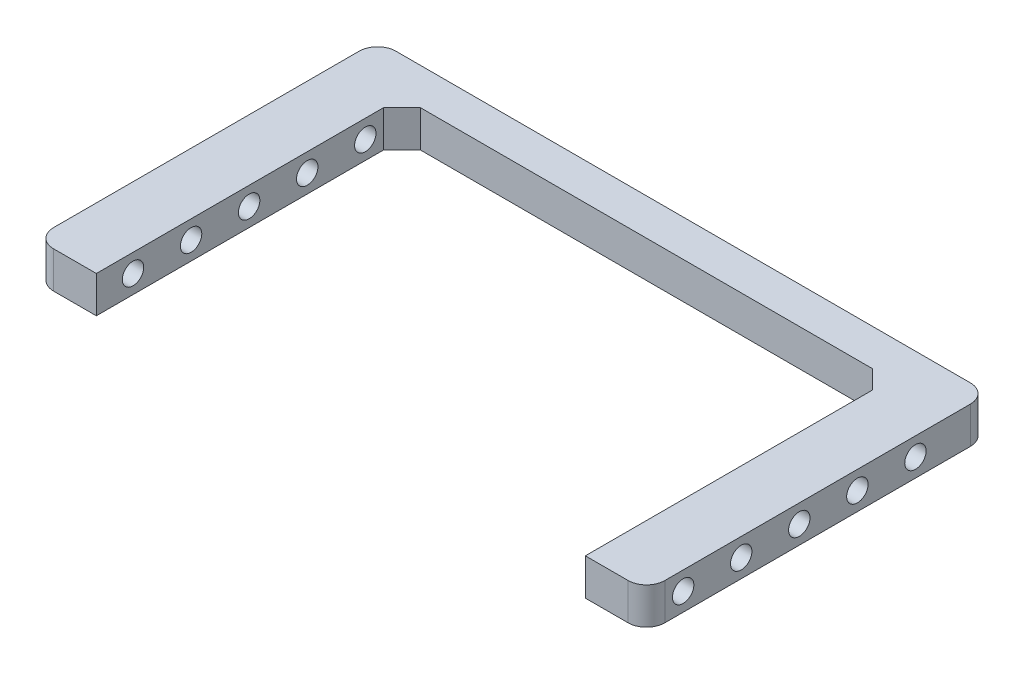
ISO-10303-21;
HEADER;
FILE_DESCRIPTION(('STEP AP214'),'2;1');
FILE_NAME('part.step','',(''),(''),'','','');
FILE_SCHEMA(('AUTOMOTIVE_DESIGN { 1 0 10303 214 1 1 1 1 }'));
ENDSEC;
DATA;
#1=APPLICATION_CONTEXT('core data for automotive mechanical design processes');
#2=APPLICATION_PROTOCOL_DEFINITION('international standard','automotive_design',2000,#1);
#3=PRODUCT_CONTEXT('',#1,'mechanical');
#4=PRODUCT('Part','Part','',(#3));
#5=PRODUCT_RELATED_PRODUCT_CATEGORY('part','',(#4));
#6=PRODUCT_DEFINITION_FORMATION('','',#4);
#7=PRODUCT_DEFINITION_CONTEXT('part definition',#1,'design');
#8=PRODUCT_DEFINITION('design','',#6,#7);
#9=PRODUCT_DEFINITION_SHAPE('','',#8);
#10=(LENGTH_UNIT() NAMED_UNIT(*) SI_UNIT(.MILLI.,.METRE.));
#11=(NAMED_UNIT(*) PLANE_ANGLE_UNIT() SI_UNIT($,.RADIAN.));
#12=(NAMED_UNIT(*) SI_UNIT($,.STERADIAN.) SOLID_ANGLE_UNIT());
#13=UNCERTAINTY_MEASURE_WITH_UNIT(LENGTH_MEASURE(1.E-05),#10,'distance_accuracy_value','');
#14=(GEOMETRIC_REPRESENTATION_CONTEXT(3) GLOBAL_UNCERTAINTY_ASSIGNED_CONTEXT((#13)) GLOBAL_UNIT_ASSIGNED_CONTEXT((#10,
#11,#12)) REPRESENTATION_CONTEXT('',''));
#15=CARTESIAN_POINT('',(0.,0.,0.));
#16=DIRECTION('',(0.,0.,1.));
#17=DIRECTION('',(1.,0.,0.));
#18=AXIS2_PLACEMENT_3D('',#15,#16,#17);
#19=CARTESIAN_POINT('',(25.,3.,14.));
#20=DIRECTION('',(-1.,0.,0.));
#21=DIRECTION('',(0.,0.,1.));
#22=AXIS2_PLACEMENT_3D('',#19,#20,#21);
#23=PLANE('',#22);
#24=CARTESIAN_POINT('',(25.,1.5,-3.25000000000002));
#25=DIRECTION('',(-1.,0.,0.));
#26=DIRECTION('',(0.,0.,1.));
#27=AXIS2_PLACEMENT_3D('',#24,#25,#26);
#28=CIRCLE('',#27,0.875);
#29=CARTESIAN_POINT('',(25.,1.5,-2.37500000000002));
#30=VERTEX_POINT('',#29);
#31=EDGE_CURVE('E328',#30,#30,#28,.F.);
#32=ORIENTED_EDGE('',*,*,#31,.F.);
#33=EDGE_LOOP('',(#32));
#34=FACE_BOUND('',#33,.T.);
#35=CARTESIAN_POINT('',(25.,1.5,1.49999999999998));
#36=DIRECTION('',(-1.,0.,0.));
#37=DIRECTION('',(0.,0.,1.));
#38=AXIS2_PLACEMENT_3D('',#35,#36,#37);
#39=CIRCLE('',#38,0.875);
#40=CARTESIAN_POINT('',(25.,1.5,2.37499999999998));
#41=VERTEX_POINT('',#40);
#42=EDGE_CURVE('E321',#41,#41,#39,.F.);
#43=ORIENTED_EDGE('',*,*,#42,.F.);
#44=EDGE_LOOP('',(#43));
#45=FACE_BOUND('',#44,.T.);
#46=CARTESIAN_POINT('',(25.,1.5,6.24999999999997));
#47=DIRECTION('',(-1.,0.,0.));
#48=DIRECTION('',(0.,0.,1.));
#49=AXIS2_PLACEMENT_3D('',#46,#47,#48);
#50=CIRCLE('',#49,0.874999999999998);
#51=CARTESIAN_POINT('',(25.,1.5,7.12499999999996));
#52=VERTEX_POINT('',#51);
#53=EDGE_CURVE('E314',#52,#52,#50,.F.);
#54=ORIENTED_EDGE('',*,*,#53,.F.);
#55=EDGE_LOOP('',(#54));
#56=FACE_BOUND('',#55,.T.);
#57=CARTESIAN_POINT('',(25.,1.5,-8.00000000000001));
#58=DIRECTION('',(-1.,0.,0.));
#59=DIRECTION('',(0.,0.,1.));
#60=AXIS2_PLACEMENT_3D('',#57,#58,#59);
#61=CIRCLE('',#60,0.875);
#62=CARTESIAN_POINT('',(25.,1.5,-7.12500000000001));
#63=VERTEX_POINT('',#62);
#64=EDGE_CURVE('E307',#63,#63,#61,.F.);
#65=ORIENTED_EDGE('',*,*,#64,.F.);
#66=EDGE_LOOP('',(#65));
#67=FACE_BOUND('',#66,.T.);
#68=CARTESIAN_POINT('',(25.,1.5,11.));
#69=DIRECTION('',(-1.,0.,0.));
#70=DIRECTION('',(0.,0.,1.));
#71=AXIS2_PLACEMENT_3D('',#68,#69,#70);
#72=CIRCLE('',#71,0.875);
#73=CARTESIAN_POINT('',(25.,1.5,11.875));
#74=VERTEX_POINT('',#73);
#75=EDGE_CURVE('E174',#74,#74,#72,.F.);
#76=ORIENTED_EDGE('',*,*,#75,.F.);
#77=EDGE_LOOP('',(#76));
#78=FACE_BOUND('',#77,.T.);
#79=DIRECTION('',(0.,0.,-1.));
#80=VECTOR('',#79,1.);
#81=CARTESIAN_POINT('',(25.,0.,14.));
#82=LINE('',#81,#80);
#83=CARTESIAN_POINT('',(25.,0.,12.5));
#84=VERTEX_POINT('',#83);
#85=CARTESIAN_POINT('',(25.,0.,-12.5));
#86=VERTEX_POINT('',#85);
#87=EDGE_CURVE('E170',#84,#86,#82,.T.);
#88=ORIENTED_EDGE('',*,*,#87,.T.);
#89=DIRECTION('',(0.,-1.,0.));
#90=VECTOR('',#89,1.);
#91=CARTESIAN_POINT('',(25.,3.,-12.5));
#92=LINE('',#91,#90);
#93=CARTESIAN_POINT('',(25.,3.,-12.5));
#94=VERTEX_POINT('',#93);
#95=EDGE_CURVE('E234',#86,#94,#92,.F.);
#96=ORIENTED_EDGE('',*,*,#95,.T.);
#97=DIRECTION('',(0.,0.,-1.));
#98=VECTOR('',#97,1.);
#99=CARTESIAN_POINT('',(25.,3.,14.));
#100=LINE('',#99,#98);
#101=CARTESIAN_POINT('',(25.,3.,12.5));
#102=VERTEX_POINT('',#101);
#103=EDGE_CURVE('E191',#102,#94,#100,.T.);
#104=ORIENTED_EDGE('',*,*,#103,.F.);
#105=DIRECTION('',(0.,-1.,0.));
#106=VECTOR('',#105,1.);
#107=CARTESIAN_POINT('',(25.,3.,12.5));
#108=LINE('',#107,#106);
#109=EDGE_CURVE('E231',#102,#84,#108,.T.);
#110=ORIENTED_EDGE('',*,*,#109,.T.);
#111=EDGE_LOOP('',(#88,#96,#104,#110));
#112=FACE_BOUND('',#111,.T.);
#113=ADVANCED_FACE('F32',(#34,#45,#56,#67,#78,#112),#23,.F.);
#114=CARTESIAN_POINT('',(-25.,3.,-14.));
#115=DIRECTION('',(0.,0.,1.));
#116=DIRECTION('',(1.,0.,0.));
#117=AXIS2_PLACEMENT_3D('',#114,#115,#116);
#118=PLANE('',#117);
#119=DIRECTION('',(-1.,0.,0.));
#120=VECTOR('',#119,1.);
#121=CARTESIAN_POINT('',(-25.,3.,-14.));
#122=LINE('',#121,#120);
#123=CARTESIAN_POINT('',(23.5,3.,-14.));
#124=VERTEX_POINT('',#123);
#125=CARTESIAN_POINT('',(-23.5,3.,-14.));
#126=VERTEX_POINT('',#125);
#127=EDGE_CURVE('E296',#124,#126,#122,.T.);
#128=ORIENTED_EDGE('',*,*,#127,.F.);
#129=DIRECTION('',(0.,-1.,0.));
#130=VECTOR('',#129,1.);
#131=CARTESIAN_POINT('',(23.5,3.,-14.));
#132=LINE('',#131,#130);
#133=CARTESIAN_POINT('',(23.5,0.,-14.));
#134=VERTEX_POINT('',#133);
#135=EDGE_CURVE('E220',#124,#134,#132,.T.);
#136=ORIENTED_EDGE('',*,*,#135,.T.);
#137=DIRECTION('',(-1.,0.,0.));
#138=VECTOR('',#137,1.);
#139=CARTESIAN_POINT('',(-25.,0.,-14.));
#140=LINE('',#139,#138);
#141=CARTESIAN_POINT('',(-23.5,0.,-14.));
#142=VERTEX_POINT('',#141);
#143=EDGE_CURVE('E173',#134,#142,#140,.T.);
#144=ORIENTED_EDGE('',*,*,#143,.T.);
#145=DIRECTION('',(0.,-1.,0.));
#146=VECTOR('',#145,1.);
#147=CARTESIAN_POINT('',(-23.5,3.,-14.));
#148=LINE('',#147,#146);
#149=EDGE_CURVE('E154',#142,#126,#148,.F.);
#150=ORIENTED_EDGE('',*,*,#149,.T.);
#151=EDGE_LOOP('',(#128,#136,#144,#150));
#152=FACE_BOUND('',#151,.T.);
#153=ADVANCED_FACE('F293',(#152),#118,.F.);
#154=CARTESIAN_POINT('',(-25.,3.,14.));
#155=DIRECTION('',(1.,0.,0.));
#156=DIRECTION('',(0.,0.,-1.));
#157=AXIS2_PLACEMENT_3D('',#154,#155,#156);
#158=PLANE('',#157);
#159=CARTESIAN_POINT('',(-25.,1.5,-3.25000000000002));
#160=DIRECTION('',(-1.,0.,0.));
#161=DIRECTION('',(0.,0.,1.));
#162=AXIS2_PLACEMENT_3D('',#159,#160,#161);
#163=CIRCLE('',#162,0.875);
#164=CARTESIAN_POINT('',(-25.,1.5,-2.37500000000002));
#165=VERTEX_POINT('',#164);
#166=EDGE_CURVE('E218',#165,#165,#163,.T.);
#167=ORIENTED_EDGE('',*,*,#166,.F.);
#168=EDGE_LOOP('',(#167));
#169=FACE_BOUND('',#168,.T.);
#170=CARTESIAN_POINT('',(-25.,1.5,1.49999999999998));
#171=DIRECTION('',(-1.,0.,0.));
#172=DIRECTION('',(0.,0.,1.));
#173=AXIS2_PLACEMENT_3D('',#170,#171,#172);
#174=CIRCLE('',#173,0.875);
#175=CARTESIAN_POINT('',(-25.,1.5,2.37499999999998));
#176=VERTEX_POINT('',#175);
#177=EDGE_CURVE('E213',#176,#176,#174,.T.);
#178=ORIENTED_EDGE('',*,*,#177,.F.);
#179=EDGE_LOOP('',(#178));
#180=FACE_BOUND('',#179,.T.);
#181=CARTESIAN_POINT('',(-25.,1.5,6.24999999999997));
#182=DIRECTION('',(-1.,0.,0.));
#183=DIRECTION('',(0.,0.,1.));
#184=AXIS2_PLACEMENT_3D('',#181,#182,#183);
#185=CIRCLE('',#184,0.874999999999998);
#186=CARTESIAN_POINT('',(-25.,1.5,7.12499999999996));
#187=VERTEX_POINT('',#186);
#188=EDGE_CURVE('E208',#187,#187,#185,.T.);
#189=ORIENTED_EDGE('',*,*,#188,.F.);
#190=EDGE_LOOP('',(#189));
#191=FACE_BOUND('',#190,.T.);
#192=CARTESIAN_POINT('',(-25.,1.5,-8.00000000000001));
#193=DIRECTION('',(-1.,0.,0.));
#194=DIRECTION('',(0.,0.,1.));
#195=AXIS2_PLACEMENT_3D('',#192,#193,#194);
#196=CIRCLE('',#195,0.875);
#197=CARTESIAN_POINT('',(-25.,1.5,-7.12500000000001));
#198=VERTEX_POINT('',#197);
#199=EDGE_CURVE('E203',#198,#198,#196,.T.);
#200=ORIENTED_EDGE('',*,*,#199,.F.);
#201=EDGE_LOOP('',(#200));
#202=FACE_BOUND('',#201,.T.);
#203=CARTESIAN_POINT('',(-25.,1.5,11.));
#204=DIRECTION('',(-1.,0.,0.));
#205=DIRECTION('',(0.,0.,1.));
#206=AXIS2_PLACEMENT_3D('',#203,#204,#205);
#207=CIRCLE('',#206,0.875);
#208=CARTESIAN_POINT('',(-25.,1.5,11.875));
#209=VERTEX_POINT('',#208);
#210=EDGE_CURVE('E198',#209,#209,#207,.T.);
#211=ORIENTED_EDGE('',*,*,#210,.F.);
#212=EDGE_LOOP('',(#211));
#213=FACE_BOUND('',#212,.T.);
#214=DIRECTION('',(0.,0.,1.));
#215=VECTOR('',#214,1.);
#216=CARTESIAN_POINT('',(-25.,3.,14.));
#217=LINE('',#216,#215);
#218=CARTESIAN_POINT('',(-25.,3.,-12.5));
#219=VERTEX_POINT('',#218);
#220=CARTESIAN_POINT('',(-25.,3.,12.5));
#221=VERTEX_POINT('',#220);
#222=EDGE_CURVE('E144',#219,#221,#217,.T.);
#223=ORIENTED_EDGE('',*,*,#222,.F.);
#224=DIRECTION('',(0.,-1.,0.));
#225=VECTOR('',#224,1.);
#226=CARTESIAN_POINT('',(-25.,3.,-12.5));
#227=LINE('',#226,#225);
#228=CARTESIAN_POINT('',(-25.,0.,-12.5));
#229=VERTEX_POINT('',#228);
#230=EDGE_CURVE('E247',#219,#229,#227,.T.);
#231=ORIENTED_EDGE('',*,*,#230,.T.);
#232=DIRECTION('',(0.,0.,1.));
#233=VECTOR('',#232,1.);
#234=CARTESIAN_POINT('',(-25.,0.,14.));
#235=LINE('',#234,#233);
#236=CARTESIAN_POINT('',(-25.,0.,12.5));
#237=VERTEX_POINT('',#236);
#238=EDGE_CURVE('E177',#229,#237,#235,.T.);
#239=ORIENTED_EDGE('',*,*,#238,.T.);
#240=DIRECTION('',(0.,-1.,0.));
#241=VECTOR('',#240,1.);
#242=CARTESIAN_POINT('',(-25.,3.,12.5));
#243=LINE('',#242,#241);
#244=EDGE_CURVE('E245',#237,#221,#243,.F.);
#245=ORIENTED_EDGE('',*,*,#244,.T.);
#246=EDGE_LOOP('',(#223,#231,#239,#245));
#247=FACE_BOUND('',#246,.T.);
#248=ADVANCED_FACE('F339',(#169,#180,#191,#202,#213,#247),#158,.F.);
#249=CARTESIAN_POINT('',(-25.,3.,14.));
#250=DIRECTION('',(0.,0.,-1.));
#251=DIRECTION('',(-1.,0.,0.));
#252=AXIS2_PLACEMENT_3D('',#249,#250,#251);
#253=PLANE('',#252);
#254=DIRECTION('',(1.,0.,0.));
#255=VECTOR('',#254,1.);
#256=CARTESIAN_POINT('',(-25.,3.,14.));
#257=LINE('',#256,#255);
#258=CARTESIAN_POINT('',(-23.5,3.,14.));
#259=VERTEX_POINT('',#258);
#260=CARTESIAN_POINT('',(-20.,3.,14.));
#261=VERTEX_POINT('',#260);
#262=EDGE_CURVE('E131',#259,#261,#257,.T.);
#263=ORIENTED_EDGE('',*,*,#262,.F.);
#264=DIRECTION('',(0.,-1.,0.));
#265=VECTOR('',#264,1.);
#266=CARTESIAN_POINT('',(-23.5,3.,14.));
#267=LINE('',#266,#265);
#268=CARTESIAN_POINT('',(-23.5,0.,14.));
#269=VERTEX_POINT('',#268);
#270=EDGE_CURVE('E250',#259,#269,#267,.T.);
#271=ORIENTED_EDGE('',*,*,#270,.T.);
#272=DIRECTION('',(1.,0.,0.));
#273=VECTOR('',#272,1.);
#274=CARTESIAN_POINT('',(-25.,0.,14.));
#275=LINE('',#274,#273);
#276=CARTESIAN_POINT('',(-20.,0.,14.));
#277=VERTEX_POINT('',#276);
#278=EDGE_CURVE('E150',#269,#277,#275,.T.);
#279=ORIENTED_EDGE('',*,*,#278,.T.);
#280=DIRECTION('',(0.,-1.,0.));
#281=VECTOR('',#280,1.);
#282=CARTESIAN_POINT('',(-20.,3.,14.));
#283=LINE('',#282,#281);
#284=EDGE_CURVE('E147',#261,#277,#283,.T.);
#285=ORIENTED_EDGE('',*,*,#284,.F.);
#286=EDGE_LOOP('',(#263,#271,#279,#285));
#287=FACE_BOUND('',#286,.T.);
#288=ADVANCED_FACE('F148',(#287),#253,.F.);
#289=CARTESIAN_POINT('',(-20.,3.,14.));
#290=DIRECTION('',(-1.,0.,0.));
#291=DIRECTION('',(0.,0.,1.));
#292=AXIS2_PLACEMENT_3D('',#289,#290,#291);
#293=PLANE('',#292);
#294=CARTESIAN_POINT('',(-20.,1.5,-3.25000000000002));
#295=DIRECTION('',(-1.,0.,0.));
#296=DIRECTION('',(0.,0.,1.));
#297=AXIS2_PLACEMENT_3D('',#294,#295,#296);
#298=CIRCLE('',#297,0.875);
#299=CARTESIAN_POINT('',(-20.,1.5,-2.37500000000002));
#300=VERTEX_POINT('',#299);
#301=EDGE_CURVE('E217',#300,#300,#298,.F.);
#302=ORIENTED_EDGE('',*,*,#301,.F.);
#303=EDGE_LOOP('',(#302));
#304=FACE_BOUND('',#303,.T.);
#305=CARTESIAN_POINT('',(-20.,1.5,1.49999999999998));
#306=DIRECTION('',(-1.,0.,0.));
#307=DIRECTION('',(0.,0.,1.));
#308=AXIS2_PLACEMENT_3D('',#305,#306,#307);
#309=CIRCLE('',#308,0.875);
#310=CARTESIAN_POINT('',(-20.,1.5,2.37499999999998));
#311=VERTEX_POINT('',#310);
#312=EDGE_CURVE('E212',#311,#311,#309,.F.);
#313=ORIENTED_EDGE('',*,*,#312,.F.);
#314=EDGE_LOOP('',(#313));
#315=FACE_BOUND('',#314,.T.);
#316=CARTESIAN_POINT('',(-20.,1.5,6.24999999999997));
#317=DIRECTION('',(-1.,0.,0.));
#318=DIRECTION('',(0.,0.,1.));
#319=AXIS2_PLACEMENT_3D('',#316,#317,#318);
#320=CIRCLE('',#319,0.874999999999998);
#321=CARTESIAN_POINT('',(-20.,1.5,7.12499999999996));
#322=VERTEX_POINT('',#321);
#323=EDGE_CURVE('E207',#322,#322,#320,.F.);
#324=ORIENTED_EDGE('',*,*,#323,.F.);
#325=EDGE_LOOP('',(#324));
#326=FACE_BOUND('',#325,.T.);
#327=CARTESIAN_POINT('',(-20.,1.5,-8.00000000000001));
#328=DIRECTION('',(-1.,0.,0.));
#329=DIRECTION('',(0.,0.,1.));
#330=AXIS2_PLACEMENT_3D('',#327,#328,#329);
#331=CIRCLE('',#330,0.875);
#332=CARTESIAN_POINT('',(-20.,1.5,-7.12500000000001));
#333=VERTEX_POINT('',#332);
#334=EDGE_CURVE('E202',#333,#333,#331,.F.);
#335=ORIENTED_EDGE('',*,*,#334,.F.);
#336=EDGE_LOOP('',(#335));
#337=FACE_BOUND('',#336,.T.);
#338=CARTESIAN_POINT('',(-20.,1.5,11.));
#339=DIRECTION('',(-1.,0.,0.));
#340=DIRECTION('',(0.,0.,1.));
#341=AXIS2_PLACEMENT_3D('',#338,#339,#340);
#342=CIRCLE('',#341,0.875);
#343=CARTESIAN_POINT('',(-20.,1.5,11.875));
#344=VERTEX_POINT('',#343);
#345=EDGE_CURVE('E197',#344,#344,#342,.F.);
#346=ORIENTED_EDGE('',*,*,#345,.F.);
#347=EDGE_LOOP('',(#346));
#348=FACE_BOUND('',#347,.T.);
#349=DIRECTION('',(0.,0.,-1.));
#350=VECTOR('',#349,1.);
#351=CARTESIAN_POINT('',(-20.,0.,14.));
#352=LINE('',#351,#350);
#353=CARTESIAN_POINT('',(-20.,0.,-9.50000000000001));
#354=VERTEX_POINT('',#353);
#355=EDGE_CURVE('E181',#277,#354,#352,.T.);
#356=ORIENTED_EDGE('',*,*,#355,.T.);
#357=DIRECTION('',(0.,1.,0.));
#358=VECTOR('',#357,1.);
#359=CARTESIAN_POINT('',(-20.,3.,-9.50000000000001));
#360=LINE('',#359,#358);
#361=CARTESIAN_POINT('',(-20.,3.,-9.50000000000001));
#362=VERTEX_POINT('',#361);
#363=EDGE_CURVE('E159',#354,#362,#360,.T.);
#364=ORIENTED_EDGE('',*,*,#363,.T.);
#365=DIRECTION('',(0.,0.,-1.));
#366=VECTOR('',#365,1.);
#367=CARTESIAN_POINT('',(-20.,3.,14.));
#368=LINE('',#367,#366);
#369=EDGE_CURVE('E136',#261,#362,#368,.T.);
#370=ORIENTED_EDGE('',*,*,#369,.F.);
#371=ORIENTED_EDGE('',*,*,#284,.T.);
#372=EDGE_LOOP('',(#356,#364,#370,#371));
#373=FACE_BOUND('',#372,.T.);
#374=ADVANCED_FACE('F157',(#304,#315,#326,#337,#348,#373),#293,.F.);
#375=CARTESIAN_POINT('',(-20.,3.,-11.));
#376=DIRECTION('',(0.,0.,-1.));
#377=DIRECTION('',(-1.,0.,0.));
#378=AXIS2_PLACEMENT_3D('',#375,#376,#377);
#379=PLANE('',#378);
#380=DIRECTION('',(1.,0.,0.));
#381=VECTOR('',#380,1.);
#382=CARTESIAN_POINT('',(-20.,3.,-11.));
#383=LINE('',#382,#381);
#384=CARTESIAN_POINT('',(-18.5,3.,-11.));
#385=VERTEX_POINT('',#384);
#386=CARTESIAN_POINT('',(18.5,3.,-11.));
#387=VERTEX_POINT('',#386);
#388=EDGE_CURVE('E160',#385,#387,#383,.T.);
#389=ORIENTED_EDGE('',*,*,#388,.F.);
#390=DIRECTION('',(0.,-1.,0.));
#391=VECTOR('',#390,1.);
#392=CARTESIAN_POINT('',(-18.5,0.,-11.));
#393=LINE('',#392,#391);
#394=CARTESIAN_POINT('',(-18.5,0.,-11.));
#395=VERTEX_POINT('',#394);
#396=EDGE_CURVE('E254',#385,#395,#393,.T.);
#397=ORIENTED_EDGE('',*,*,#396,.T.);
#398=DIRECTION('',(1.,0.,0.));
#399=VECTOR('',#398,1.);
#400=CARTESIAN_POINT('',(-20.,0.,-11.));
#401=LINE('',#400,#399);
#402=CARTESIAN_POINT('',(18.5,0.,-11.));
#403=VERTEX_POINT('',#402);
#404=EDGE_CURVE('E183',#395,#403,#401,.T.);
#405=ORIENTED_EDGE('',*,*,#404,.T.);
#406=DIRECTION('',(0.,1.,0.));
#407=VECTOR('',#406,1.);
#408=CARTESIAN_POINT('',(18.5,3.,-11.));
#409=LINE('',#408,#407);
#410=EDGE_CURVE('E252',#403,#387,#409,.T.);
#411=ORIENTED_EDGE('',*,*,#410,.T.);
#412=EDGE_LOOP('',(#389,#397,#405,#411));
#413=FACE_BOUND('',#412,.T.);
#414=ADVANCED_FACE('F271',(#413),#379,.F.);
#415=CARTESIAN_POINT('',(20.,3.,-11.));
#416=DIRECTION('',(1.,0.,0.));
#417=DIRECTION('',(0.,0.,-1.));
#418=AXIS2_PLACEMENT_3D('',#415,#416,#417);
#419=PLANE('',#418);
#420=CARTESIAN_POINT('',(20.,1.5,-3.25000000000002));
#421=DIRECTION('',(1.,0.,0.));
#422=DIRECTION('',(0.,0.,-1.));
#423=AXIS2_PLACEMENT_3D('',#420,#421,#422);
#424=CIRCLE('',#423,0.875);
#425=CARTESIAN_POINT('',(20.,1.5,-4.12500000000002));
#426=VERTEX_POINT('',#425);
#427=EDGE_CURVE('E214',#426,#426,#424,.F.);
#428=ORIENTED_EDGE('',*,*,#427,.F.);
#429=EDGE_LOOP('',(#428));
#430=FACE_BOUND('',#429,.T.);
#431=CARTESIAN_POINT('',(20.,1.5,1.49999999999998));
#432=DIRECTION('',(1.,0.,0.));
#433=DIRECTION('',(0.,0.,-1.));
#434=AXIS2_PLACEMENT_3D('',#431,#432,#433);
#435=CIRCLE('',#434,0.875);
#436=CARTESIAN_POINT('',(20.,1.5,0.624999999999975));
#437=VERTEX_POINT('',#436);
#438=EDGE_CURVE('E209',#437,#437,#435,.F.);
#439=ORIENTED_EDGE('',*,*,#438,.F.);
#440=EDGE_LOOP('',(#439));
#441=FACE_BOUND('',#440,.T.);
#442=CARTESIAN_POINT('',(20.,1.5,6.24999999999997));
#443=DIRECTION('',(1.,0.,0.));
#444=DIRECTION('',(0.,0.,-1.));
#445=AXIS2_PLACEMENT_3D('',#442,#443,#444);
#446=CIRCLE('',#445,0.874999999999998);
#447=CARTESIAN_POINT('',(20.,1.5,5.37499999999997));
#448=VERTEX_POINT('',#447);
#449=EDGE_CURVE('E204',#448,#448,#446,.F.);
#450=ORIENTED_EDGE('',*,*,#449,.F.);
#451=EDGE_LOOP('',(#450));
#452=FACE_BOUND('',#451,.T.);
#453=CARTESIAN_POINT('',(20.,1.5,-8.00000000000001));
#454=DIRECTION('',(1.,0.,0.));
#455=DIRECTION('',(0.,0.,-1.));
#456=AXIS2_PLACEMENT_3D('',#453,#454,#455);
#457=CIRCLE('',#456,0.875);
#458=CARTESIAN_POINT('',(20.,1.5,-8.87500000000001));
#459=VERTEX_POINT('',#458);
#460=EDGE_CURVE('E199',#459,#459,#457,.F.);
#461=ORIENTED_EDGE('',*,*,#460,.F.);
#462=EDGE_LOOP('',(#461));
#463=FACE_BOUND('',#462,.T.);
#464=CARTESIAN_POINT('',(20.,1.5,11.));
#465=DIRECTION('',(1.,0.,0.));
#466=DIRECTION('',(0.,0.,-1.));
#467=AXIS2_PLACEMENT_3D('',#464,#465,#466);
#468=CIRCLE('',#467,0.875);
#469=CARTESIAN_POINT('',(20.,1.5,10.125));
#470=VERTEX_POINT('',#469);
#471=EDGE_CURVE('E194',#470,#470,#468,.F.);
#472=ORIENTED_EDGE('',*,*,#471,.F.);
#473=EDGE_LOOP('',(#472));
#474=FACE_BOUND('',#473,.T.);
#475=DIRECTION('',(0.,0.,1.));
#476=VECTOR('',#475,1.);
#477=CARTESIAN_POINT('',(20.,3.,-11.));
#478=LINE('',#477,#476);
#479=CARTESIAN_POINT('',(20.,3.,-9.49999999999998));
#480=VERTEX_POINT('',#479);
#481=CARTESIAN_POINT('',(20.,3.,14.));
#482=VERTEX_POINT('',#481);
#483=EDGE_CURVE('E162',#480,#482,#478,.T.);
#484=ORIENTED_EDGE('',*,*,#483,.F.);
#485=DIRECTION('',(0.,-1.,0.));
#486=VECTOR('',#485,1.);
#487=CARTESIAN_POINT('',(20.,0.,-9.49999999999998));
#488=LINE('',#487,#486);
#489=CARTESIAN_POINT('',(20.,0.,-9.49999999999998));
#490=VERTEX_POINT('',#489);
#491=EDGE_CURVE('E258',#480,#490,#488,.T.);
#492=ORIENTED_EDGE('',*,*,#491,.T.);
#493=DIRECTION('',(0.,0.,1.));
#494=VECTOR('',#493,1.);
#495=CARTESIAN_POINT('',(20.,0.,-11.));
#496=LINE('',#495,#494);
#497=CARTESIAN_POINT('',(20.,0.,14.));
#498=VERTEX_POINT('',#497);
#499=EDGE_CURVE('E186',#490,#498,#496,.T.);
#500=ORIENTED_EDGE('',*,*,#499,.T.);
#501=DIRECTION('',(0.,-1.,0.));
#502=VECTOR('',#501,1.);
#503=CARTESIAN_POINT('',(20.,3.,14.));
#504=LINE('',#503,#502);
#505=EDGE_CURVE('E155',#482,#498,#504,.T.);
#506=ORIENTED_EDGE('',*,*,#505,.F.);
#507=EDGE_LOOP('',(#484,#492,#500,#506));
#508=FACE_BOUND('',#507,.T.);
#509=ADVANCED_FACE('F274',(#430,#441,#452,#463,#474,#508),#419,.F.);
#510=CARTESIAN_POINT('',(20.,3.,14.));
#511=DIRECTION('',(0.,0.,-1.));
#512=DIRECTION('',(-1.,0.,0.));
#513=AXIS2_PLACEMENT_3D('',#510,#511,#512);
#514=PLANE('',#513);
#515=DIRECTION('',(1.,0.,0.));
#516=VECTOR('',#515,1.);
#517=CARTESIAN_POINT('',(20.,0.,14.));
#518=LINE('',#517,#516);
#519=CARTESIAN_POINT('',(23.5,0.,14.));
#520=VERTEX_POINT('',#519);
#521=EDGE_CURVE('E188',#498,#520,#518,.T.);
#522=ORIENTED_EDGE('',*,*,#521,.T.);
#523=DIRECTION('',(0.,-1.,0.));
#524=VECTOR('',#523,1.);
#525=CARTESIAN_POINT('',(23.5,3.,14.));
#526=LINE('',#525,#524);
#527=CARTESIAN_POINT('',(23.5,3.,14.));
#528=VERTEX_POINT('',#527);
#529=EDGE_CURVE('E243',#520,#528,#526,.F.);
#530=ORIENTED_EDGE('',*,*,#529,.T.);
#531=DIRECTION('',(1.,0.,0.));
#532=VECTOR('',#531,1.);
#533=CARTESIAN_POINT('',(20.,3.,14.));
#534=LINE('',#533,#532);
#535=EDGE_CURVE('E167',#482,#528,#534,.T.);
#536=ORIENTED_EDGE('',*,*,#535,.F.);
#537=ORIENTED_EDGE('',*,*,#505,.T.);
#538=EDGE_LOOP('',(#522,#530,#536,#537));
#539=FACE_BOUND('',#538,.T.);
#540=ADVANCED_FACE('F419',(#539),#514,.F.);
#541=CARTESIAN_POINT('',(0.,3.,0.));
#542=DIRECTION('',(0.,-1.,0.));
#543=DIRECTION('',(0.,0.,-1.));
#544=AXIS2_PLACEMENT_3D('',#541,#542,#543);
#545=PLANE('',#544);
#546=ORIENTED_EDGE('',*,*,#103,.T.);
#547=CARTESIAN_POINT('',(23.5,3.,-12.5));
#548=DIRECTION('',(0.,-1.,0.));
#549=DIRECTION('',(0.,0.,-1.));
#550=AXIS2_PLACEMENT_3D('',#547,#548,#549);
#551=CIRCLE('',#550,1.5);
#552=EDGE_CURVE('E241',#94,#124,#551,.F.);
#553=ORIENTED_EDGE('',*,*,#552,.T.);
#554=ORIENTED_EDGE('',*,*,#127,.T.);
#555=CARTESIAN_POINT('',(-23.5,3.,-12.5));
#556=DIRECTION('',(0.,-1.,0.));
#557=DIRECTION('',(0.,0.,-1.));
#558=AXIS2_PLACEMENT_3D('',#555,#556,#557);
#559=CIRCLE('',#558,1.5);
#560=EDGE_CURVE('E237',#126,#219,#559,.F.);
#561=ORIENTED_EDGE('',*,*,#560,.T.);
#562=ORIENTED_EDGE('',*,*,#222,.T.);
#563=CARTESIAN_POINT('',(-23.5,3.,12.5));
#564=DIRECTION('',(0.,-1.,0.));
#565=DIRECTION('',(0.,0.,-1.));
#566=AXIS2_PLACEMENT_3D('',#563,#564,#565);
#567=CIRCLE('',#566,1.5);
#568=EDGE_CURVE('E140',#221,#259,#567,.F.);
#569=ORIENTED_EDGE('',*,*,#568,.T.);
#570=ORIENTED_EDGE('',*,*,#262,.T.);
#571=ORIENTED_EDGE('',*,*,#369,.T.);
#572=DIRECTION('',(-0.707106781186552,0.,0.707106781186543));
#573=VECTOR('',#572,1.);
#574=CARTESIAN_POINT('',(-14.7499999999999,3.,-14.7500000000001));
#575=LINE('',#574,#573);
#576=EDGE_CURVE('E262',#362,#385,#575,.F.);
#577=ORIENTED_EDGE('',*,*,#576,.T.);
#578=ORIENTED_EDGE('',*,*,#388,.T.);
#579=DIRECTION('',(-0.707106781186543,0.,-0.707106781186552));
#580=VECTOR('',#579,1.);
#581=CARTESIAN_POINT('',(14.7500000000001,3.,-14.7499999999999));
#582=LINE('',#581,#580);
#583=EDGE_CURVE('E11',#387,#480,#582,.F.);
#584=ORIENTED_EDGE('',*,*,#583,.T.);
#585=ORIENTED_EDGE('',*,*,#483,.T.);
#586=ORIENTED_EDGE('',*,*,#535,.T.);
#587=CARTESIAN_POINT('',(23.5,3.,12.5));
#588=DIRECTION('',(0.,-1.,0.));
#589=DIRECTION('',(0.,0.,-1.));
#590=AXIS2_PLACEMENT_3D('',#587,#588,#589);
#591=CIRCLE('',#590,1.5);
#592=EDGE_CURVE('E239',#528,#102,#591,.F.);
#593=ORIENTED_EDGE('',*,*,#592,.T.);
#594=EDGE_LOOP('',(#546,#553,#554,#561,#562,#569,#570,#571,#577,#578,#584,#585,#586,#593));
#595=FACE_BOUND('',#594,.T.);
#596=ADVANCED_FACE('F134',(#595),#545,.F.);
#597=CARTESIAN_POINT('',(0.,0.,0.));
#598=DIRECTION('',(0.,-1.,0.));
#599=DIRECTION('',(0.,0.,-1.));
#600=AXIS2_PLACEMENT_3D('',#597,#598,#599);
#601=PLANE('',#600);
#602=ORIENTED_EDGE('',*,*,#143,.F.);
#603=CARTESIAN_POINT('',(23.5,0.,-12.5));
#604=DIRECTION('',(0.,-1.,0.));
#605=DIRECTION('',(0.,0.,-1.));
#606=AXIS2_PLACEMENT_3D('',#603,#604,#605);
#607=CIRCLE('',#606,1.5);
#608=EDGE_CURVE('E229',#134,#86,#607,.T.);
#609=ORIENTED_EDGE('',*,*,#608,.T.);
#610=ORIENTED_EDGE('',*,*,#87,.F.);
#611=CARTESIAN_POINT('',(23.5,0.,12.5));
#612=DIRECTION('',(0.,-1.,0.));
#613=DIRECTION('',(0.,0.,-1.));
#614=AXIS2_PLACEMENT_3D('',#611,#612,#613);
#615=CIRCLE('',#614,1.5);
#616=EDGE_CURVE('E227',#84,#520,#615,.T.);
#617=ORIENTED_EDGE('',*,*,#616,.T.);
#618=ORIENTED_EDGE('',*,*,#521,.F.);
#619=ORIENTED_EDGE('',*,*,#499,.F.);
#620=DIRECTION('',(0.707106781186543,0.,0.707106781186552));
#621=VECTOR('',#620,1.);
#622=CARTESIAN_POINT('',(20.,0.,-9.49999999999998));
#623=LINE('',#622,#621);
#624=EDGE_CURVE('E40',#490,#403,#623,.F.);
#625=ORIENTED_EDGE('',*,*,#624,.T.);
#626=ORIENTED_EDGE('',*,*,#404,.F.);
#627=DIRECTION('',(0.707106781186552,0.,-0.707106781186543));
#628=VECTOR('',#627,1.);
#629=CARTESIAN_POINT('',(-18.5,0.,-11.));
#630=LINE('',#629,#628);
#631=EDGE_CURVE('E260',#395,#354,#630,.F.);
#632=ORIENTED_EDGE('',*,*,#631,.T.);
#633=ORIENTED_EDGE('',*,*,#355,.F.);
#634=ORIENTED_EDGE('',*,*,#278,.F.);
#635=CARTESIAN_POINT('',(-23.5,0.,12.5));
#636=DIRECTION('',(0.,-1.,0.));
#637=DIRECTION('',(0.,0.,-1.));
#638=AXIS2_PLACEMENT_3D('',#635,#636,#637);
#639=CIRCLE('',#638,1.5);
#640=EDGE_CURVE('E223',#269,#237,#639,.T.);
#641=ORIENTED_EDGE('',*,*,#640,.T.);
#642=ORIENTED_EDGE('',*,*,#238,.F.);
#643=CARTESIAN_POINT('',(-23.5,0.,-12.5));
#644=DIRECTION('',(0.,-1.,0.));
#645=DIRECTION('',(0.,0.,-1.));
#646=AXIS2_PLACEMENT_3D('',#643,#644,#645);
#647=CIRCLE('',#646,1.5);
#648=EDGE_CURVE('E225',#229,#142,#647,.T.);
#649=ORIENTED_EDGE('',*,*,#648,.T.);
#650=EDGE_LOOP('',(#602,#609,#610,#617,#618,#619,#625,#626,#632,#633,#634,#641,#642,#649));
#651=FACE_BOUND('',#650,.T.);
#652=ADVANCED_FACE('F267',(#651),#601,.T.);
#653=CARTESIAN_POINT('',(-25.,1.5,11.));
#654=DIRECTION('',(1.,0.,0.));
#655=DIRECTION('',(0.,0.,-1.));
#656=AXIS2_PLACEMENT_3D('',#653,#654,#655);
#657=CYLINDRICAL_SURFACE('',#656,0.875);
#658=ORIENTED_EDGE('',*,*,#471,.T.);
#659=EDGE_LOOP('',(#658));
#660=FACE_BOUND('',#659,.T.);
#661=ORIENTED_EDGE('',*,*,#75,.T.);
#662=EDGE_LOOP('',(#661));
#663=FACE_BOUND('',#662,.T.);
#664=ADVANCED_FACE('F438',(#660,#663),#657,.F.);
#665=ORIENTED_EDGE('',*,*,#210,.T.);
#666=EDGE_LOOP('',(#665));
#667=FACE_BOUND('',#666,.T.);
#668=ORIENTED_EDGE('',*,*,#345,.T.);
#669=EDGE_LOOP('',(#668));
#670=FACE_BOUND('',#669,.T.);
#671=ADVANCED_FACE('F457',(#667,#670),#657,.F.);
#672=CARTESIAN_POINT('',(-25.,1.5,-8.00000000000001));
#673=DIRECTION('',(1.,0.,0.));
#674=DIRECTION('',(0.,0.,-1.));
#675=AXIS2_PLACEMENT_3D('',#672,#673,#674);
#676=CYLINDRICAL_SURFACE('',#675,0.875);
#677=ORIENTED_EDGE('',*,*,#460,.T.);
#678=EDGE_LOOP('',(#677));
#679=FACE_BOUND('',#678,.T.);
#680=ORIENTED_EDGE('',*,*,#64,.T.);
#681=EDGE_LOOP('',(#680));
#682=FACE_BOUND('',#681,.T.);
#683=ADVANCED_FACE('F464',(#679,#682),#676,.F.);
#684=ORIENTED_EDGE('',*,*,#199,.T.);
#685=EDGE_LOOP('',(#684));
#686=FACE_BOUND('',#685,.T.);
#687=ORIENTED_EDGE('',*,*,#334,.T.);
#688=EDGE_LOOP('',(#687));
#689=FACE_BOUND('',#688,.T.);
#690=ADVANCED_FACE('F471',(#686,#689),#676,.F.);
#691=CARTESIAN_POINT('',(-25.,1.5,6.24999999999997));
#692=DIRECTION('',(1.,0.,0.));
#693=DIRECTION('',(0.,0.,-1.));
#694=AXIS2_PLACEMENT_3D('',#691,#692,#693);
#695=CYLINDRICAL_SURFACE('',#694,0.874999999999998);
#696=ORIENTED_EDGE('',*,*,#449,.T.);
#697=EDGE_LOOP('',(#696));
#698=FACE_BOUND('',#697,.T.);
#699=ORIENTED_EDGE('',*,*,#53,.T.);
#700=EDGE_LOOP('',(#699));
#701=FACE_BOUND('',#700,.T.);
#702=ADVANCED_FACE('F479',(#698,#701),#695,.F.);
#703=ORIENTED_EDGE('',*,*,#188,.T.);
#704=EDGE_LOOP('',(#703));
#705=FACE_BOUND('',#704,.T.);
#706=ORIENTED_EDGE('',*,*,#323,.T.);
#707=EDGE_LOOP('',(#706));
#708=FACE_BOUND('',#707,.T.);
#709=ADVANCED_FACE('F486',(#705,#708),#695,.F.);
#710=CARTESIAN_POINT('',(-25.,1.5,1.49999999999998));
#711=DIRECTION('',(1.,0.,0.));
#712=DIRECTION('',(0.,0.,-1.));
#713=AXIS2_PLACEMENT_3D('',#710,#711,#712);
#714=CYLINDRICAL_SURFACE('',#713,0.875);
#715=ORIENTED_EDGE('',*,*,#438,.T.);
#716=EDGE_LOOP('',(#715));
#717=FACE_BOUND('',#716,.T.);
#718=ORIENTED_EDGE('',*,*,#42,.T.);
#719=EDGE_LOOP('',(#718));
#720=FACE_BOUND('',#719,.T.);
#721=ADVANCED_FACE('F494',(#717,#720),#714,.F.);
#722=ORIENTED_EDGE('',*,*,#177,.T.);
#723=EDGE_LOOP('',(#722));
#724=FACE_BOUND('',#723,.T.);
#725=ORIENTED_EDGE('',*,*,#312,.T.);
#726=EDGE_LOOP('',(#725));
#727=FACE_BOUND('',#726,.T.);
#728=ADVANCED_FACE('F501',(#724,#727),#714,.F.);
#729=CARTESIAN_POINT('',(-25.,1.5,-3.25000000000002));
#730=DIRECTION('',(1.,0.,0.));
#731=DIRECTION('',(0.,0.,-1.));
#732=AXIS2_PLACEMENT_3D('',#729,#730,#731);
#733=CYLINDRICAL_SURFACE('',#732,0.875);
#734=ORIENTED_EDGE('',*,*,#427,.T.);
#735=EDGE_LOOP('',(#734));
#736=FACE_BOUND('',#735,.T.);
#737=ORIENTED_EDGE('',*,*,#31,.T.);
#738=EDGE_LOOP('',(#737));
#739=FACE_BOUND('',#738,.T.);
#740=ADVANCED_FACE('F509',(#736,#739),#733,.F.);
#741=ORIENTED_EDGE('',*,*,#166,.T.);
#742=EDGE_LOOP('',(#741));
#743=FACE_BOUND('',#742,.T.);
#744=ORIENTED_EDGE('',*,*,#301,.T.);
#745=EDGE_LOOP('',(#744));
#746=FACE_BOUND('',#745,.T.);
#747=ADVANCED_FACE('F336',(#743,#746),#733,.F.);
#748=CARTESIAN_POINT('',(23.5,3.,-12.5));
#749=DIRECTION('',(0.,-1.,0.));
#750=DIRECTION('',(0.,0.,-1.));
#751=AXIS2_PLACEMENT_3D('',#748,#749,#750);
#752=CYLINDRICAL_SURFACE('',#751,1.5);
#753=ORIENTED_EDGE('',*,*,#552,.F.);
#754=ORIENTED_EDGE('',*,*,#95,.F.);
#755=ORIENTED_EDGE('',*,*,#608,.F.);
#756=ORIENTED_EDGE('',*,*,#135,.F.);
#757=EDGE_LOOP('',(#753,#754,#755,#756));
#758=FACE_BOUND('',#757,.T.);
#759=ADVANCED_FACE('F290',(#758),#752,.T.);
#760=CARTESIAN_POINT('',(23.5,3.,12.5));
#761=DIRECTION('',(0.,-1.,0.));
#762=DIRECTION('',(0.,0.,-1.));
#763=AXIS2_PLACEMENT_3D('',#760,#761,#762);
#764=CYLINDRICAL_SURFACE('',#763,1.5);
#765=ORIENTED_EDGE('',*,*,#592,.F.);
#766=ORIENTED_EDGE('',*,*,#529,.F.);
#767=ORIENTED_EDGE('',*,*,#616,.F.);
#768=ORIENTED_EDGE('',*,*,#109,.F.);
#769=EDGE_LOOP('',(#765,#766,#767,#768));
#770=FACE_BOUND('',#769,.T.);
#771=ADVANCED_FACE('F283',(#770),#764,.T.);
#772=CARTESIAN_POINT('',(-23.5,3.,-12.5));
#773=DIRECTION('',(0.,-1.,0.));
#774=DIRECTION('',(0.,0.,-1.));
#775=AXIS2_PLACEMENT_3D('',#772,#773,#774);
#776=CYLINDRICAL_SURFACE('',#775,1.5);
#777=ORIENTED_EDGE('',*,*,#560,.F.);
#778=ORIENTED_EDGE('',*,*,#149,.F.);
#779=ORIENTED_EDGE('',*,*,#648,.F.);
#780=ORIENTED_EDGE('',*,*,#230,.F.);
#781=EDGE_LOOP('',(#777,#778,#779,#780));
#782=FACE_BOUND('',#781,.T.);
#783=ADVANCED_FACE('F356',(#782),#776,.T.);
#784=CARTESIAN_POINT('',(-23.5,3.,12.5));
#785=DIRECTION('',(0.,-1.,0.));
#786=DIRECTION('',(0.,0.,-1.));
#787=AXIS2_PLACEMENT_3D('',#784,#785,#786);
#788=CYLINDRICAL_SURFACE('',#787,1.5);
#789=ORIENTED_EDGE('',*,*,#568,.F.);
#790=ORIENTED_EDGE('',*,*,#244,.F.);
#791=ORIENTED_EDGE('',*,*,#640,.F.);
#792=ORIENTED_EDGE('',*,*,#270,.F.);
#793=EDGE_LOOP('',(#789,#790,#791,#792));
#794=FACE_BOUND('',#793,.T.);
#795=ADVANCED_FACE('F358',(#794),#788,.T.);
#796=CARTESIAN_POINT('',(-18.5,3.,-11.));
#797=DIRECTION('',(0.707106781186543,0.,0.707106781186552));
#798=DIRECTION('',(0.,1.,0.));
#799=AXIS2_PLACEMENT_3D('',#796,#797,#798);
#800=PLANE('',#799);
#801=ORIENTED_EDGE('',*,*,#576,.F.);
#802=ORIENTED_EDGE('',*,*,#363,.F.);
#803=ORIENTED_EDGE('',*,*,#631,.F.);
#804=ORIENTED_EDGE('',*,*,#396,.F.);
#805=EDGE_LOOP('',(#801,#802,#803,#804));
#806=FACE_BOUND('',#805,.T.);
#807=ADVANCED_FACE('F360',(#806),#800,.T.);
#808=CARTESIAN_POINT('',(20.,3.,-9.49999999999998));
#809=DIRECTION('',(-0.707106781186552,0.,0.707106781186543));
#810=DIRECTION('',(0.,1.,0.));
#811=AXIS2_PLACEMENT_3D('',#808,#809,#810);
#812=PLANE('',#811);
#813=ORIENTED_EDGE('',*,*,#583,.F.);
#814=ORIENTED_EDGE('',*,*,#410,.F.);
#815=ORIENTED_EDGE('',*,*,#624,.F.);
#816=ORIENTED_EDGE('',*,*,#491,.F.);
#817=EDGE_LOOP('',(#813,#814,#815,#816));
#818=FACE_BOUND('',#817,.T.);
#819=ADVANCED_FACE('F34',(#818),#812,.T.);
#820=CLOSED_SHELL('',(#113,#153,#248,#288,#374,#414,#509,#540,#596,#652,#664,#671,#683,#690,
#702,#709,#721,#728,#740,#747,#759,#771,#783,#795,#807,#819));
#821=MANIFOLD_SOLID_BREP('B2',#820);
#822=ADVANCED_BREP_SHAPE_REPRESENTATION('',(#18,#821),#14);
#823=SHAPE_DEFINITION_REPRESENTATION(#9,#822);
ENDSEC;
END-ISO-10303-21;
